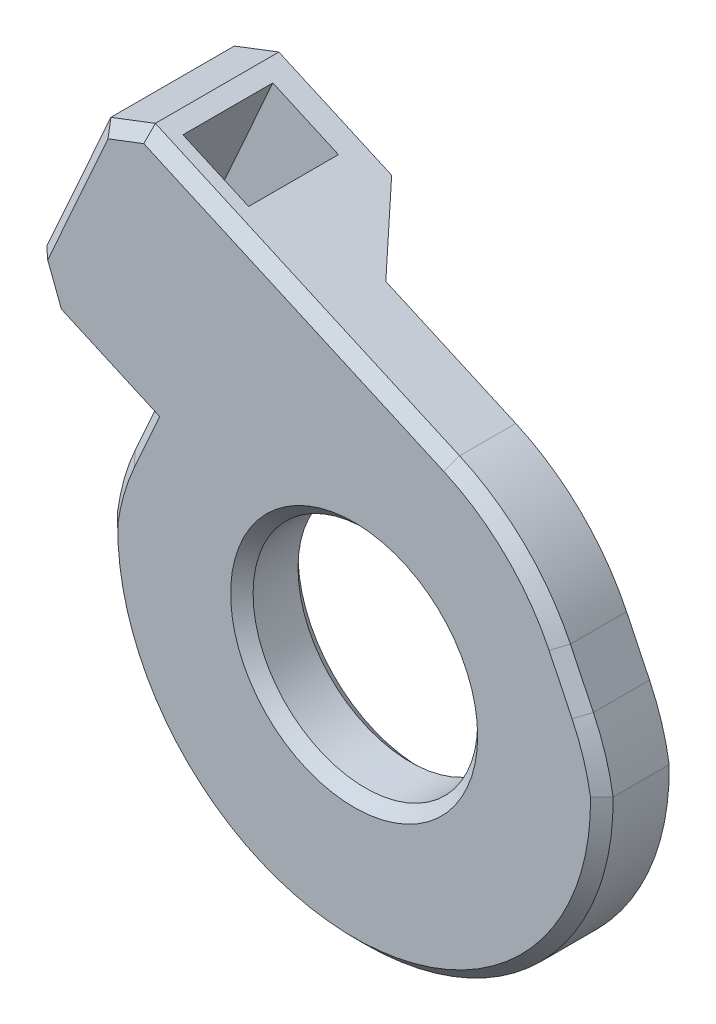
ISO-10303-21;
HEADER;
FILE_DESCRIPTION(('STEP AP214'),'2;1');
FILE_NAME('part.step','',(''),(''),'','','');
FILE_SCHEMA(('AUTOMOTIVE_DESIGN { 1 0 10303 214 1 1 1 1 }'));
ENDSEC;
DATA;
#1=APPLICATION_CONTEXT('core data for automotive mechanical design processes');
#2=APPLICATION_PROTOCOL_DEFINITION('international standard','automotive_design',2000,#1);
#3=PRODUCT_CONTEXT('',#1,'mechanical');
#4=PRODUCT('Part','Part','',(#3));
#5=PRODUCT_RELATED_PRODUCT_CATEGORY('part','',(#4));
#6=PRODUCT_DEFINITION_FORMATION('','',#4);
#7=PRODUCT_DEFINITION_CONTEXT('part definition',#1,'design');
#8=PRODUCT_DEFINITION('design','',#6,#7);
#9=PRODUCT_DEFINITION_SHAPE('','',#8);
#10=(LENGTH_UNIT() NAMED_UNIT(*) SI_UNIT(.MILLI.,.METRE.));
#11=(NAMED_UNIT(*) PLANE_ANGLE_UNIT() SI_UNIT($,.RADIAN.));
#12=(NAMED_UNIT(*) SI_UNIT($,.STERADIAN.) SOLID_ANGLE_UNIT());
#13=UNCERTAINTY_MEASURE_WITH_UNIT(LENGTH_MEASURE(1.E-05),#10,'distance_accuracy_value','');
#14=(GEOMETRIC_REPRESENTATION_CONTEXT(3) GLOBAL_UNCERTAINTY_ASSIGNED_CONTEXT((#13)) GLOBAL_UNIT_ASSIGNED_CONTEXT((#10,
#11,#12)) REPRESENTATION_CONTEXT('',''));
#15=CARTESIAN_POINT('',(0.,0.,0.));
#16=DIRECTION('',(0.,0.,1.));
#17=DIRECTION('',(1.,0.,0.));
#18=AXIS2_PLACEMENT_3D('',#15,#16,#17);
#19=CARTESIAN_POINT('',(-15.9993335903611,0.238477868257378,-6.));
#20=DIRECTION('',(-0.0149038320618569,-0.999888931726855,0.));
#21=DIRECTION('',(0.999888931726855,-0.0149038320618569,0.));
#22=AXIS2_PLACEMENT_3D('',#19,#20,#21);
#23=PLANE('',#22);
#24=DIRECTION('',(-0.999888931726855,0.0149038320618569,0.));
#25=VECTOR('',#24,1.);
#26=CARTESIAN_POINT('',(-15.9993335903611,0.238477868257378,0.));
#27=LINE('',#26,#25);
#28=CARTESIAN_POINT('',(-10.5248777993057,0.156878435409332,0.));
#29=VERTEX_POINT('',#28);
#30=CARTESIAN_POINT('',(-10.5260992697237,0.156896642021487,0.));
#31=VERTEX_POINT('',#30);
#32=EDGE_CURVE('E227',#29,#31,#27,.T.);
#33=ORIENTED_EDGE('',*,*,#32,.T.);
#34=CARTESIAN_POINT('',(-10.5258977055362,0.156893637608992,0.0001999999999994));
#35=CARTESIAN_POINT('',(-10.6099324570567,0.158146216554795,-0.0831834659332892));
#36=CARTESIAN_POINT('',(-10.6939591198566,0.159398674934272,-0.166575082414103));
#37=CARTESIAN_POINT('',(-10.8619962679745,0.161903350559971,-0.333374616430507));
#38=CARTESIAN_POINT('',(-10.9460067532926,0.163155567806193,-0.41678253396609));
#39=CARTESIAN_POINT('',(-11.03000914989,0.16440766448609,-0.500198602049191));
#40=B_SPLINE_CURVE_WITH_KNOTS('',3,(#34,#35,#36,#37,#38,#39),.UNSPECIFIED.,.F.,.F.,(4,2,4),(0.,
0.355170232019879,0.710340463868253),.UNSPECIFIED.);
#41=CARTESIAN_POINT('',(-11.02980914989,0.164404683388573,-0.5));
#42=VERTEX_POINT('',#41);
#43=EDGE_CURVE('E217',#31,#42,#40,.T.);
#44=ORIENTED_EDGE('',*,*,#43,.T.);
#45=CARTESIAN_POINT('',(961.76732595328,-14.3356109401404,-982.604791657124));
#46=DIRECTION('',(0.0149038320618569,0.999888931726855,0.));
#47=DIRECTION('',(0.999888931726855,-0.0149038320618569,0.));
#48=AXIS2_PLACEMENT_3D('',#45,#46,#47);
#49=CIRCLE('',#48,1382.41612342807);
#50=EDGE_CURVE('E223',#42,#29,#49,.T.);
#51=ORIENTED_EDGE('',*,*,#50,.T.);
#52=EDGE_LOOP('',(#33,#44,#51));
#53=FACE_BOUND('',#52,.T.);
#54=ADVANCED_FACE('F33',(#53),#23,.T.);
#55=CARTESIAN_POINT('',(-4.2451482351309,-11.7156911617328,0.));
#56=DIRECTION('',(0.,0.,-1.));
#57=DIRECTION('',(1.,0.,0.));
#58=AXIS2_PLACEMENT_3D('',#55,#56,#57);
#59=PLANE('',#58);
#60=CARTESIAN_POINT('',(0.,0.,0.));
#61=DIRECTION('',(0.,0.,1.));
#62=DIRECTION('',(1.,0.,0.));
#63=AXIS2_PLACEMENT_3D('',#60,#61,#62);
#64=CIRCLE('',#63,5.49999999999999);
#65=CARTESIAN_POINT('',(5.49999999999999,0.,0.));
#66=VERTEX_POINT('',#65);
#67=EDGE_CURVE('E401',#66,#66,#64,.T.);
#68=ORIENTED_EDGE('',*,*,#67,.F.);
#69=EDGE_LOOP('',(#68));
#70=FACE_BOUND('',#69,.T.);
#71=CARTESIAN_POINT('',(1.14507573860424,-1.34954557596995,0.));
#72=DIRECTION('',(0.,0.,1.));
#73=DIRECTION('',(1.,0.,0.));
#74=AXIS2_PLACEMENT_3D('',#71,#72,#73);
#75=CIRCLE('',#74,9.49999999999999);
#76=CARTESIAN_POINT('',(9.70434222245121,2.77222070300485,0.));
#77=VERTEX_POINT('',#76);
#78=CARTESIAN_POINT('',(10.5248777993057,0.156878435409331,0.));
#79=VERTEX_POINT('',#78);
#80=EDGE_CURVE('E398',#77,#79,#75,.F.);
#81=ORIENTED_EDGE('',*,*,#80,.F.);
#82=DIRECTION('',(0.433870134628927,-0.900975419352313,0.));
#83=VECTOR('',#82,1.);
#84=CARTESIAN_POINT('',(12.7418605985402,-3.53549484194215,0.));
#85=LINE('',#84,#83);
#86=CARTESIAN_POINT('',(8.68008532829212,4.89919421670095,0.));
#87=VERTEX_POINT('',#86);
#88=EDGE_CURVE('E395',#87,#77,#85,.T.);
#89=ORIENTED_EDGE('',*,*,#88,.F.);
#90=CARTESIAN_POINT('',(0.120818844445147,0.777427937726146,0.));
#91=DIRECTION('',(0.,0.,1.));
#92=DIRECTION('',(1.,0.,0.));
#93=AXIS2_PLACEMENT_3D('',#90,#91,#92);
#94=CIRCLE('',#93,9.49999999999999);
#95=CARTESIAN_POINT('',(3.99350182799709,9.45223782088251,0.));
#96=VERTEX_POINT('',#95);
#97=EDGE_CURVE('E392',#96,#87,#94,.F.);
#98=ORIENTED_EDGE('',*,*,#97,.F.);
#99=DIRECTION('',(0.913137882437511,-0.407650840373888,0.));
#100=VECTOR('',#99,1.);
#101=CARTESIAN_POINT('',(5.00352415655121,9.00133499563513,0.));
#102=LINE('',#101,#100);
#103=CARTESIAN_POINT('',(-9.36618042540207,15.4163816840071,0.));
#104=VERTEX_POINT('',#103);
#105=EDGE_CURVE('E389',#104,#96,#102,.T.);
#106=ORIENTED_EDGE('',*,*,#105,.F.);
#107=DIRECTION('',(0.933938662414661,0.357433315245115,0.));
#108=VECTOR('',#107,1.);
#109=CARTESIAN_POINT('',(-9.1727553952037,15.4904085474164,0.));
#110=LINE('',#109,#108);
#111=CARTESIAN_POINT('',(-10.9605134492224,14.8062048477302,0.));
#112=VERTEX_POINT('',#111);
#113=EDGE_CURVE('E386',#112,#104,#110,.T.);
#114=ORIENTED_EDGE('',*,*,#113,.F.);
#115=DIRECTION('',(0.407650840373888,0.913137882437511,0.));
#116=VECTOR('',#115,1.);
#117=CARTESIAN_POINT('',(-19.7171077471328,-4.80856637958912,0.));
#118=LINE('',#117,#116);
#119=CARTESIAN_POINT('',(-13.645214825044,8.79247376588988,0.));
#120=VERTEX_POINT('',#119);
#121=EDGE_CURVE('E383',#120,#112,#118,.T.);
#122=ORIENTED_EDGE('',*,*,#121,.F.);
#123=DIRECTION('',(-0.357433315245115,0.933938662414661,0.));
#124=VECTOR('',#123,1.);
#125=CARTESIAN_POINT('',(-13.7192416884533,8.98589879608826,0.));
#126=LINE('',#125,#124);
#127=CARTESIAN_POINT('',(-13.0350379887671,7.19814074206954,0.));
#128=VERTEX_POINT('',#127);
#129=EDGE_CURVE('E380',#128,#120,#126,.T.);
#130=ORIENTED_EDGE('',*,*,#129,.F.);
#131=DIRECTION('',(-0.913137882437511,0.407650840373888,0.));
#132=VECTOR('',#131,1.);
#133=CARTESIAN_POINT('',(1.33466659318622,0.783094053697537,0.));
#134=LINE('',#133,#132);
#135=CARTESIAN_POINT('',(-8.65846562419064,5.24431379359792,0.));
#136=VERTEX_POINT('',#135);
#137=EDGE_CURVE('E377',#136,#128,#134,.T.);
#138=ORIENTED_EDGE('',*,*,#137,.F.);
#139=DIRECTION('',(0.407650840373889,0.913137882437511,0.));
#140=VECTOR('',#139,1.);
#141=CARTESIAN_POINT('',(-14.2382804525078,-7.25447142183244,0.));
#142=LINE('',#141,#140);
#143=CARTESIAN_POINT('',(-9.79445235154937,2.69970352431435,0.));
#144=VERTEX_POINT('',#143);
#145=EDGE_CURVE('E374',#144,#136,#142,.T.);
#146=ORIENTED_EDGE('',*,*,#145,.F.);
#147=CARTESIAN_POINT('',(-1.11964246839302,-1.17297945923759,0.));
#148=DIRECTION('',(0.,0.,1.));
#149=DIRECTION('',(1.,0.,0.));
#150=AXIS2_PLACEMENT_3D('',#147,#148,#149);
#151=CIRCLE('',#150,9.49999999999999);
#152=EDGE_CURVE('E372',#31,#144,#151,.F.);
#153=ORIENTED_EDGE('',*,*,#152,.F.);
#154=ORIENTED_EDGE('',*,*,#32,.F.);
#155=CARTESIAN_POINT('',(0.,0.,0.));
#156=DIRECTION('',(0.,0.,1.));
#157=DIRECTION('',(1.,0.,0.));
#158=AXIS2_PLACEMENT_3D('',#155,#156,#157);
#159=CIRCLE('',#158,10.526046909159);
#160=EDGE_CURVE('E52',#29,#79,#159,.T.);
#161=ORIENTED_EDGE('',*,*,#160,.T.);
#162=EDGE_LOOP('',(#81,#89,#98,#106,#114,#122,#130,#138,#146,#153,#154,#161));
#163=FACE_BOUND('',#162,.T.);
#164=ADVANCED_FACE('F297',(#70,#163),#59,.F.);
#165=CARTESIAN_POINT('',(0.,0.,-3.));
#166=DIRECTION('',(0.,0.,-1.));
#167=DIRECTION('',(1.,0.,0.));
#168=AXIS2_PLACEMENT_3D('',#165,#166,#167);
#169=PLANE('',#168);
#170=CARTESIAN_POINT('',(0.,0.,-3.));
#171=DIRECTION('',(0.,0.,1.));
#172=DIRECTION('',(1.,0.,0.));
#173=AXIS2_PLACEMENT_3D('',#170,#171,#172);
#174=CIRCLE('',#173,11.0310343478261);
#175=CARTESIAN_POINT('',(-11.02980914989,0.164404683388573,-3.));
#176=VERTEX_POINT('',#175);
#177=CARTESIAN_POINT('',(11.0298091498901,0.164404683388573,-3.));
#178=VERTEX_POINT('',#177);
#179=EDGE_CURVE('E228',#176,#178,#174,.T.);
#180=ORIENTED_EDGE('',*,*,#179,.F.);
#181=CARTESIAN_POINT('',(-1.11964246839302,-1.17297945923759,-3.));
#182=DIRECTION('',(0.,0.,1.));
#183=DIRECTION('',(1.,0.,0.));
#184=AXIS2_PLACEMENT_3D('',#181,#182,#183);
#185=CIRCLE('',#184,10.);
#186=CARTESIAN_POINT('',(-10.2510212927681,2.9035289445013,-3.));
#187=VERTEX_POINT('',#186);
#188=EDGE_CURVE('E208',#187,#176,#185,.T.);
#189=ORIENTED_EDGE('',*,*,#188,.F.);
#190=DIRECTION('',(-0.407650840373889,-0.913137882437511,0.));
#191=VECTOR('',#190,1.);
#192=CARTESIAN_POINT('',(-10.9494633470919,1.33901874281605,-3.));
#193=LINE('',#192,#191);
#194=CARTESIAN_POINT('',(-9.31885998559635,4.9915702725661,-3.));
#195=VERTEX_POINT('',#194);
#196=EDGE_CURVE('E356',#195,#187,#193,.T.);
#197=ORIENTED_EDGE('',*,*,#196,.F.);
#198=DIRECTION('',(-0.913137882437511,0.407650840373888,0.));
#199=VECTOR('',#198,1.);
#200=CARTESIAN_POINT('',(-13.3700468447189,6.80013583467437,-3.));
#201=LINE('',#200,#199);
#202=CARTESIAN_POINT('',(-5.6663084558463,3.36096691107054,-3.));
#203=VERTEX_POINT('',#202);
#204=EDGE_CURVE('E463',#203,#195,#201,.T.);
#205=ORIENTED_EDGE('',*,*,#204,.F.);
#206=DIRECTION('',(-0.407650840373888,-0.913137882437511,0.));
#207=VECTOR('',#206,1.);
#208=CARTESIAN_POINT('',(-5.6663084558463,3.36096691107054,-3.));
#209=LINE('',#208,#207);
#210=CARTESIAN_POINT('',(-1.58980005210742,12.4923457354457,-3.));
#211=VERTEX_POINT('',#210);
#212=EDGE_CURVE('E453',#211,#203,#209,.T.);
#213=ORIENTED_EDGE('',*,*,#212,.F.);
#214=DIRECTION('',(-0.913137882437512,0.407650840373888,0.));
#215=VECTOR('',#214,1.);
#216=CARTESIAN_POINT('',(-10.7211788764825,16.5688541391845,-3.));
#217=LINE('',#216,#215);
#218=CARTESIAN_POINT('',(4.19732724818404,9.90880676210126,-3.));
#219=VERTEX_POINT('',#218);
#220=EDGE_CURVE('E355',#219,#211,#217,.T.);
#221=ORIENTED_EDGE('',*,*,#220,.F.);
#222=CARTESIAN_POINT('',(0.120818844445147,0.777427937726146,-3.));
#223=DIRECTION('',(0.,0.,1.));
#224=DIRECTION('',(1.,0.,0.));
#225=AXIS2_PLACEMENT_3D('',#222,#223,#224);
#226=CIRCLE('',#225,10.);
#227=CARTESIAN_POINT('',(9.13057303796828,5.11612928401542,-3.));
#228=VERTEX_POINT('',#227);
#229=EDGE_CURVE('E342',#228,#219,#226,.T.);
#230=ORIENTED_EDGE('',*,*,#229,.F.);
#231=DIRECTION('',(-0.433870134628927,0.900975419352313,0.));
#232=VECTOR('',#231,1.);
#233=CARTESIAN_POINT('',(10.9494633470919,1.33901874281605,-3.));
#234=LINE('',#233,#232);
#235=CARTESIAN_POINT('',(10.1548299321274,2.98915577031932,-3.));
#236=VERTEX_POINT('',#235);
#237=EDGE_CURVE('E351',#236,#228,#234,.T.);
#238=ORIENTED_EDGE('',*,*,#237,.F.);
#239=CARTESIAN_POINT('',(1.14507573860424,-1.34954557596995,-3.));
#240=DIRECTION('',(0.,0.,1.));
#241=DIRECTION('',(1.,0.,0.));
#242=AXIS2_PLACEMENT_3D('',#239,#240,#241);
#243=CIRCLE('',#242,10.);
#244=EDGE_CURVE('E360',#178,#236,#243,.T.);
#245=ORIENTED_EDGE('',*,*,#244,.F.);
#246=EDGE_LOOP('',(#180,#189,#197,#205,#213,#221,#230,#238,#245));
#247=FACE_BOUND('',#246,.T.);
#248=CARTESIAN_POINT('',(0.,0.,-3.));
#249=DIRECTION('',(0.,0.,1.));
#250=DIRECTION('',(1.,0.,0.));
#251=AXIS2_PLACEMENT_3D('',#248,#249,#250);
#252=CIRCLE('',#251,5.49999999999999);
#253=CARTESIAN_POINT('',(5.49999999999999,0.,-3.));
#254=VERTEX_POINT('',#253);
#255=EDGE_CURVE('E220',#254,#254,#252,.F.);
#256=ORIENTED_EDGE('',*,*,#255,.F.);
#257=EDGE_LOOP('',(#256));
#258=FACE_BOUND('',#257,.T.);
#259=ADVANCED_FACE('F286',(#247,#258),#169,.T.);
#260=CARTESIAN_POINT('',(1.14507573860424,-1.34954557596995,0.));
#261=DIRECTION('',(0.,0.,-1.));
#262=DIRECTION('',(1.,0.,0.));
#263=AXIS2_PLACEMENT_3D('',#260,#261,#262);
#264=CONICAL_SURFACE('',#263,9.49999999999999,0.785398163397454);
#265=CARTESIAN_POINT('',(1.14507573860424,-1.34954557596995,-0.5));
#266=DIRECTION('',(0.,0.,1.));
#267=DIRECTION('',(1.,0.,0.));
#268=AXIS2_PLACEMENT_3D('',#265,#266,#267);
#269=CIRCLE('',#268,10.);
#270=CARTESIAN_POINT('',(11.02980914989,0.164404683388572,-0.499999999999999));
#271=VERTEX_POINT('',#270);
#272=CARTESIAN_POINT('',(10.1548299321274,2.98915577031932,-0.5));
#273=VERTEX_POINT('',#272);
#274=EDGE_CURVE('E410',#271,#273,#269,.T.);
#275=ORIENTED_EDGE('',*,*,#274,.T.);
#276=DIRECTION('',(-0.637085828706418,-0.306792514350437,0.707106781186543));
#277=VECTOR('',#276,1.);
#278=CARTESIAN_POINT('',(10.1548299321274,2.98915577031932,-0.5));
#279=LINE('',#278,#277);
#280=EDGE_CURVE('E447',#273,#77,#279,.T.);
#281=ORIENTED_EDGE('',*,*,#280,.T.);
#282=ORIENTED_EDGE('',*,*,#80,.T.);
#283=CARTESIAN_POINT('',(11.0300091498901,0.164407664486091,-0.500198146029022));
#284=CARTESIAN_POINT('',(10.9458083624873,0.163152610694507,-0.416776787823409));
#285=CARTESIAN_POINT('',(10.8615968496548,0.161897397035162,-0.333366263235881));
#286=CARTESIAN_POINT('',(10.6931523730585,0.159386649979884,-0.166566881226189));
#287=CARTESIAN_POINT('',(10.6089194092948,0.158131116583951,-0.0831780238040435));
#288=CARTESIAN_POINT('',(10.5246757201012,0.156875423320256,0.000199999999998424));
#289=B_SPLINE_CURVE_WITH_KNOTS('',3,(#283,#284,#285,#286,#287,#288),.UNSPECIFIED.,.F.,.F.,(4,2,
4),(0.,0.355604036256066,0.711208072814042),.UNSPECIFIED.);
#290=EDGE_CURVE('E11',#271,#79,#289,.T.);
#291=ORIENTED_EDGE('',*,*,#290,.F.);
#292=EDGE_LOOP('',(#275,#281,#282,#291));
#293=FACE_BOUND('',#292,.T.);
#294=ADVANCED_FACE('F249',(#293),#264,.T.);
#295=CARTESIAN_POINT('',(-1.11964246839302,-1.17297945923759,0.));
#296=DIRECTION('',(0.,0.,-1.));
#297=DIRECTION('',(1.,0.,0.));
#298=AXIS2_PLACEMENT_3D('',#295,#296,#297);
#299=CONICAL_SURFACE('',#298,9.49999999999999,0.785398163397454);
#300=ORIENTED_EDGE('',*,*,#152,.T.);
#301=DIRECTION('',(0.64568598882989,-0.288252673584773,0.707106781186546));
#302=VECTOR('',#301,1.);
#303=CARTESIAN_POINT('',(-10.2510212927681,2.9035289445013,-0.5));
#304=LINE('',#303,#302);
#305=CARTESIAN_POINT('',(-10.2510212927681,2.9035289445013,-0.5));
#306=VERTEX_POINT('',#305);
#307=EDGE_CURVE('E219',#306,#144,#304,.T.);
#308=ORIENTED_EDGE('',*,*,#307,.F.);
#309=CARTESIAN_POINT('',(-1.11964246839302,-1.17297945923759,-0.5));
#310=DIRECTION('',(0.,0.,1.));
#311=DIRECTION('',(1.,0.,0.));
#312=AXIS2_PLACEMENT_3D('',#309,#310,#311);
#313=CIRCLE('',#312,10.);
#314=EDGE_CURVE('E205',#306,#42,#313,.T.);
#315=ORIENTED_EDGE('',*,*,#314,.T.);
#316=ORIENTED_EDGE('',*,*,#43,.F.);
#317=EDGE_LOOP('',(#300,#308,#315,#316));
#318=FACE_BOUND('',#317,.T.);
#319=ADVANCED_FACE('F215',(#318),#299,.T.);
#320=CARTESIAN_POINT('',(10.9494633470919,1.33901874281605,-36.6176859496457));
#321=DIRECTION('',(-0.900975419352313,-0.433870134628927,0.));
#322=DIRECTION('',(0.433870134628927,-0.900975419352313,0.));
#323=AXIS2_PLACEMENT_3D('',#320,#321,#322);
#324=PLANE('',#323);
#325=DIRECTION('',(0.,0.,1.));
#326=VECTOR('',#325,1.);
#327=CARTESIAN_POINT('',(10.1548299321274,2.98915577031932,-36.6176859496457));
#328=LINE('',#327,#326);
#329=EDGE_CURVE('E348',#236,#273,#328,.T.);
#330=ORIENTED_EDGE('',*,*,#329,.F.);
#331=ORIENTED_EDGE('',*,*,#237,.T.);
#332=DIRECTION('',(0.,0.,1.));
#333=VECTOR('',#332,1.);
#334=CARTESIAN_POINT('',(9.13057303796828,5.11612928401542,-36.6176859496457));
#335=LINE('',#334,#333);
#336=CARTESIAN_POINT('',(9.13057303796828,5.11612928401542,-0.5));
#337=VERTEX_POINT('',#336);
#338=EDGE_CURVE('E338',#337,#228,#335,.F.);
#339=ORIENTED_EDGE('',*,*,#338,.F.);
#340=DIRECTION('',(-0.433870134628927,0.900975419352313,0.));
#341=VECTOR('',#340,1.);
#342=CARTESIAN_POINT('',(10.9494633470919,1.33901874281605,-0.5));
#343=LINE('',#342,#341);
#344=EDGE_CURVE('E413',#273,#337,#343,.T.);
#345=ORIENTED_EDGE('',*,*,#344,.F.);
#346=EDGE_LOOP('',(#330,#331,#339,#345));
#347=FACE_BOUND('',#346,.T.);
#348=ADVANCED_FACE('F248',(#347),#324,.F.);
#349=CARTESIAN_POINT('',(-10.9494633470919,1.33901874281605,-36.6176859496457));
#350=DIRECTION('',(0.913137882437511,-0.407650840373889,0.));
#351=DIRECTION('',(0.407650840373889,0.913137882437511,0.));
#352=AXIS2_PLACEMENT_3D('',#349,#350,#351);
#353=PLANE('',#352);
#354=DIRECTION('',(0.,0.,1.));
#355=VECTOR('',#354,1.);
#356=CARTESIAN_POINT('',(-9.31885998559635,4.9915702725661,-36.6176859496457));
#357=LINE('',#356,#355);
#358=CARTESIAN_POINT('',(-9.31885998559635,4.9915702725661,-0.5));
#359=VERTEX_POINT('',#358);
#360=EDGE_CURVE('E459',#195,#359,#357,.T.);
#361=ORIENTED_EDGE('',*,*,#360,.F.);
#362=ORIENTED_EDGE('',*,*,#196,.T.);
#363=DIRECTION('',(0.,0.,1.));
#364=VECTOR('',#363,1.);
#365=CARTESIAN_POINT('',(-10.2510212927681,2.9035289445013,-36.6176859496457));
#366=LINE('',#365,#364);
#367=EDGE_CURVE('E361',#306,#187,#366,.F.);
#368=ORIENTED_EDGE('',*,*,#367,.F.);
#369=DIRECTION('',(-0.407650840373889,-0.913137882437511,0.));
#370=VECTOR('',#369,1.);
#371=CARTESIAN_POINT('',(-10.9494633470919,1.33901874281605,-0.5));
#372=LINE('',#371,#370);
#373=EDGE_CURVE('E221',#359,#306,#372,.T.);
#374=ORIENTED_EDGE('',*,*,#373,.F.);
#375=EDGE_LOOP('',(#361,#362,#368,#374));
#376=FACE_BOUND('',#375,.T.);
#377=ADVANCED_FACE('F525',(#376),#353,.F.);
#378=CARTESIAN_POINT('',(0.,0.,-6.));
#379=DIRECTION('',(0.,0.,1.));
#380=DIRECTION('',(-1.,0.,0.));
#381=AXIS2_PLACEMENT_3D('',#378,#379,#380);
#382=CYLINDRICAL_SURFACE('',#381,5.);
#383=CARTESIAN_POINT('',(0.,0.,-0.499999999999998));
#384=DIRECTION('',(0.,0.,1.));
#385=DIRECTION('',(1.,0.,0.));
#386=AXIS2_PLACEMENT_3D('',#383,#384,#385);
#387=CIRCLE('',#386,5.);
#388=CARTESIAN_POINT('',(5.,0.,-0.499999999999998));
#389=VERTEX_POINT('',#388);
#390=EDGE_CURVE('E407',#389,#389,#387,.F.);
#391=ORIENTED_EDGE('',*,*,#390,.F.);
#392=EDGE_LOOP('',(#391));
#393=FACE_BOUND('',#392,.T.);
#394=CARTESIAN_POINT('',(0.,0.,-2.50000000000001));
#395=DIRECTION('',(0.,0.,1.));
#396=DIRECTION('',(1.,0.,0.));
#397=AXIS2_PLACEMENT_3D('',#394,#395,#396);
#398=CIRCLE('',#397,5.);
#399=CARTESIAN_POINT('',(5.,0.,-2.50000000000001));
#400=VERTEX_POINT('',#399);
#401=EDGE_CURVE('E404',#400,#400,#398,.T.);
#402=ORIENTED_EDGE('',*,*,#401,.F.);
#403=EDGE_LOOP('',(#402));
#404=FACE_BOUND('',#403,.T.);
#405=ADVANCED_FACE('F552',(#393,#404),#382,.F.);
#406=CARTESIAN_POINT('',(-4.2451482351309,-11.7156911617328,-6.));
#407=DIRECTION('',(0.,0.,-1.));
#408=DIRECTION('',(1.,0.,0.));
#409=AXIS2_PLACEMENT_3D('',#406,#407,#408);
#410=PLANE('',#409);
#411=DIRECTION('',(0.913137882437512,-0.407650840373888,0.));
#412=VECTOR('',#411,1.);
#413=CARTESIAN_POINT('',(-9.31885998559635,4.9915702725661,-6.));
#414=LINE('',#413,#412);
#415=CARTESIAN_POINT('',(-13.4279804565652,6.8259990542486,-6.));
#416=VERTEX_POINT('',#415);
#417=CARTESIAN_POINT('',(-8.40572210315885,4.58391943219221,-6.));
#418=VERTEX_POINT('',#417);
#419=EDGE_CURVE('E210',#416,#418,#414,.T.);
#420=ORIENTED_EDGE('',*,*,#419,.F.);
#421=DIRECTION('',(-0.357433315245115,0.933938662414661,0.));
#422=VECTOR('',#421,1.);
#423=CARTESIAN_POINT('',(-6.06519317962719,-12.4122515725894,-6.));
#424=LINE('',#423,#422);
#425=CARTESIAN_POINT('',(-14.1862110196606,8.80718213846571,-6.));
#426=VERTEX_POINT('',#425);
#427=EDGE_CURVE('E496',#426,#416,#424,.F.);
#428=ORIENTED_EDGE('',*,*,#427,.F.);
#429=DIRECTION('',(-0.407650840373888,-0.913137882437512,0.));
#430=VECTOR('',#429,1.);
#431=CARTESIAN_POINT('',(-14.7976872802214,7.43747531480943,-6.));
#432=LINE('',#431,#430);
#433=CARTESIAN_POINT('',(-11.3326551370434,15.1991473155283,-6.));
#434=VERTEX_POINT('',#433);
#435=EDGE_CURVE('E477',#434,#426,#432,.T.);
#436=ORIENTED_EDGE('',*,*,#435,.F.);
#437=DIRECTION('',(0.933938662414661,0.357433315245115,0.));
#438=VECTOR('',#437,1.);
#439=CARTESIAN_POINT('',(-14.1353707223869,14.1265030791622,-6.));
#440=LINE('',#439,#438);
#441=CARTESIAN_POINT('',(-9.35147205282626,15.9573778786237,-6.));
#442=VERTEX_POINT('',#441);
#443=EDGE_CURVE('E493',#442,#434,#440,.F.);
#444=ORIENTED_EDGE('',*,*,#443,.F.);
#445=DIRECTION('',(-0.913137882437512,0.407650840373888,0.));
#446=VECTOR('',#445,1.);
#447=CARTESIAN_POINT('',(-10.7211788764825,16.5688541391845,-6.));
#448=LINE('',#447,#446);
#449=CARTESIAN_POINT('',(-4.32921369941997,13.7152982565673,-6.));
#450=VERTEX_POINT('',#449);
#451=EDGE_CURVE('E480',#450,#442,#448,.T.);
#452=ORIENTED_EDGE('',*,*,#451,.F.);
#453=DIRECTION('',(0.407650840373888,0.913137882437511,0.));
#454=VECTOR('',#453,1.);
#455=CARTESIAN_POINT('',(-4.32921369941997,13.7152982565673,-6.));
#456=LINE('',#455,#454);
#457=EDGE_CURVE('E451',#418,#450,#456,.T.);
#458=ORIENTED_EDGE('',*,*,#457,.F.);
#459=EDGE_LOOP('',(#420,#428,#436,#444,#452,#458));
#460=FACE_BOUND('',#459,.T.);
#461=ADVANCED_FACE('F312',(#460),#410,.T.);
#462=CARTESIAN_POINT('',(-10.7211788764825,16.5688541391845,-36.6176859496457));
#463=DIRECTION('',(-0.407650840373888,-0.913137882437512,0.));
#464=DIRECTION('',(0.913137882437512,-0.407650840373888,0.));
#465=AXIS2_PLACEMENT_3D('',#462,#463,#464);
#466=PLANE('',#465);
#467=DIRECTION('',(0.913137882437512,-0.407650840373888,0.));
#468=VECTOR('',#467,1.);
#469=CARTESIAN_POINT('',(-8.62096174687625,15.6312572063246,-5.));
#470=LINE('',#469,#468);
#471=CARTESIAN_POINT('',(-8.62096174687627,15.6312572063246,-5.));
#472=VERTEX_POINT('',#471);
#473=CARTESIAN_POINT('',(-5.69892052307621,14.3267745171282,-5.));
#474=VERTEX_POINT('',#473);
#475=EDGE_CURVE('E593',#472,#474,#470,.T.);
#476=ORIENTED_EDGE('',*,*,#475,.T.);
#477=DIRECTION('',(0.,0.,1.));
#478=VECTOR('',#477,1.);
#479=CARTESIAN_POINT('',(-5.69892052307621,14.3267745171282,-5.));
#480=LINE('',#479,#478);
#481=CARTESIAN_POINT('',(-5.69892052307621,14.3267745171282,-1.));
#482=VERTEX_POINT('',#481);
#483=EDGE_CURVE('E588',#474,#482,#480,.T.);
#484=ORIENTED_EDGE('',*,*,#483,.T.);
#485=DIRECTION('',(-0.913137882437512,0.407650840373888,0.));
#486=VECTOR('',#485,1.);
#487=CARTESIAN_POINT('',(-8.62096174687625,15.6312572063246,-1.));
#488=LINE('',#487,#486);
#489=CARTESIAN_POINT('',(-8.62096174687625,15.6312572063246,-1.));
#490=VERTEX_POINT('',#489);
#491=EDGE_CURVE('E583',#482,#490,#488,.T.);
#492=ORIENTED_EDGE('',*,*,#491,.T.);
#493=DIRECTION('',(0.,0.,-1.));
#494=VECTOR('',#493,1.);
#495=CARTESIAN_POINT('',(-8.62096174687625,15.6312572063246,-5.));
#496=LINE('',#495,#494);
#497=EDGE_CURVE('E590',#490,#472,#496,.T.);
#498=ORIENTED_EDGE('',*,*,#497,.T.);
#499=EDGE_LOOP('',(#476,#484,#492,#498));
#500=FACE_BOUND('',#499,.T.);
#501=ORIENTED_EDGE('',*,*,#451,.T.);
#502=DIRECTION('',(0.,0.,-1.));
#503=VECTOR('',#502,1.);
#504=CARTESIAN_POINT('',(-9.35147205282626,15.9573778786237,-36.6176859496457));
#505=LINE('',#504,#503);
#506=CARTESIAN_POINT('',(-9.35147205282626,15.9573778786237,-0.5));
#507=VERTEX_POINT('',#506);
#508=EDGE_CURVE('E364',#507,#442,#505,.T.);
#509=ORIENTED_EDGE('',*,*,#508,.F.);
#510=DIRECTION('',(-0.913137882437512,0.407650840373888,0.));
#511=VECTOR('',#510,1.);
#512=CARTESIAN_POINT('',(-10.7211788764825,16.5688541391845,-0.5));
#513=LINE('',#512,#511);
#514=CARTESIAN_POINT('',(4.19732724818403,9.90880676210126,-0.5));
#515=VERTEX_POINT('',#514);
#516=EDGE_CURVE('E416',#515,#507,#513,.T.);
#517=ORIENTED_EDGE('',*,*,#516,.F.);
#518=DIRECTION('',(0.,0.,1.));
#519=VECTOR('',#518,1.);
#520=CARTESIAN_POINT('',(4.19732724818403,9.90880676210126,-36.6176859496457));
#521=LINE('',#520,#519);
#522=EDGE_CURVE('E370',#219,#515,#521,.T.);
#523=ORIENTED_EDGE('',*,*,#522,.F.);
#524=ORIENTED_EDGE('',*,*,#220,.T.);
#525=DIRECTION('',(0.64568598882989,-0.288252673584772,0.707106781186546));
#526=VECTOR('',#525,1.);
#527=CARTESIAN_POINT('',(-1.58980005210742,12.4923457354457,-3.));
#528=LINE('',#527,#526);
#529=EDGE_CURVE('E46',#450,#211,#528,.T.);
#530=ORIENTED_EDGE('',*,*,#529,.F.);
#531=EDGE_LOOP('',(#501,#509,#517,#523,#524,#530));
#532=FACE_BOUND('',#531,.T.);
#533=ADVANCED_FACE('F457',(#500,#532),#466,.F.);
#534=CARTESIAN_POINT('',(-14.7976872802214,7.43747531480943,-36.6176859496457));
#535=DIRECTION('',(0.913137882437512,-0.407650840373888,0.));
#536=DIRECTION('',(0.407650840373888,0.913137882437512,0.));
#537=AXIS2_PLACEMENT_3D('',#534,#535,#536);
#538=PLANE('',#537);
#539=DIRECTION('',(0.,0.,1.));
#540=VECTOR('',#539,1.);
#541=CARTESIAN_POINT('',(-11.3326551370434,15.1991473155283,-36.6176859496457));
#542=LINE('',#541,#540);
#543=CARTESIAN_POINT('',(-11.3326551370434,15.1991473155283,-0.5));
#544=VERTEX_POINT('',#543);
#545=EDGE_CURVE('E488',#434,#544,#542,.T.);
#546=ORIENTED_EDGE('',*,*,#545,.F.);
#547=ORIENTED_EDGE('',*,*,#435,.T.);
#548=DIRECTION('',(0.,0.,-1.));
#549=VECTOR('',#548,1.);
#550=CARTESIAN_POINT('',(-14.1862110196606,8.8071821384657,-36.6176859496457));
#551=LINE('',#550,#549);
#552=CARTESIAN_POINT('',(-14.1862110196606,8.8071821384657,-0.5));
#553=VERTEX_POINT('',#552);
#554=EDGE_CURVE('E491',#553,#426,#551,.T.);
#555=ORIENTED_EDGE('',*,*,#554,.F.);
#556=DIRECTION('',(-0.407650840373888,-0.913137882437512,0.));
#557=VECTOR('',#556,1.);
#558=CARTESIAN_POINT('',(-14.7976872802214,7.43747531480943,-0.5));
#559=LINE('',#558,#557);
#560=EDGE_CURVE('E422',#544,#553,#559,.T.);
#561=ORIENTED_EDGE('',*,*,#560,.F.);
#562=EDGE_LOOP('',(#546,#547,#555,#561));
#563=FACE_BOUND('',#562,.T.);
#564=ADVANCED_FACE('F507',(#563),#538,.F.);
#565=CARTESIAN_POINT('',(-9.31885998559635,4.9915702725661,-36.6176859496457));
#566=DIRECTION('',(0.407650840373888,0.913137882437512,0.));
#567=DIRECTION('',(-0.913137882437512,0.407650840373888,0.));
#568=AXIS2_PLACEMENT_3D('',#565,#566,#567);
#569=PLANE('',#568);
#570=DIRECTION('',(0.913137882437512,-0.407650840373888,0.));
#571=VECTOR('',#570,1.);
#572=CARTESIAN_POINT('',(-12.6974701506151,6.49987838194949,-1.));
#573=LINE('',#572,#571);
#574=CARTESIAN_POINT('',(-12.6974701506151,6.49987838194949,-1.));
#575=VERTEX_POINT('',#574);
#576=CARTESIAN_POINT('',(-9.7754289268151,5.19539569275304,-1.));
#577=VERTEX_POINT('',#576);
#578=EDGE_CURVE('E468',#575,#577,#573,.T.);
#579=ORIENTED_EDGE('',*,*,#578,.T.);
#580=DIRECTION('',(0.,0.,-1.));
#581=VECTOR('',#580,1.);
#582=CARTESIAN_POINT('',(-9.7754289268151,5.19539569275304,-5.));
#583=LINE('',#582,#581);
#584=CARTESIAN_POINT('',(-9.77542892681511,5.19539569275304,-5.));
#585=VERTEX_POINT('',#584);
#586=EDGE_CURVE('E464',#577,#585,#583,.T.);
#587=ORIENTED_EDGE('',*,*,#586,.T.);
#588=DIRECTION('',(-0.913137882437512,0.407650840373888,0.));
#589=VECTOR('',#588,1.);
#590=CARTESIAN_POINT('',(-12.6974701506151,6.49987838194949,-5.));
#591=LINE('',#590,#589);
#592=CARTESIAN_POINT('',(-12.6974701506151,6.49987838194949,-5.));
#593=VERTEX_POINT('',#592);
#594=EDGE_CURVE('E240',#585,#593,#591,.T.);
#595=ORIENTED_EDGE('',*,*,#594,.T.);
#596=DIRECTION('',(0.,0.,1.));
#597=VECTOR('',#596,1.);
#598=CARTESIAN_POINT('',(-12.6974701506151,6.49987838194948,-5.));
#599=LINE('',#598,#597);
#600=EDGE_CURVE('E582',#593,#575,#599,.T.);
#601=ORIENTED_EDGE('',*,*,#600,.T.);
#602=EDGE_LOOP('',(#579,#587,#595,#601));
#603=FACE_BOUND('',#602,.T.);
#604=ORIENTED_EDGE('',*,*,#204,.T.);
#605=ORIENTED_EDGE('',*,*,#360,.T.);
#606=DIRECTION('',(0.913137882437512,-0.407650840373888,0.));
#607=VECTOR('',#606,1.);
#608=CARTESIAN_POINT('',(-9.31885998559635,4.9915702725661,-0.5));
#609=LINE('',#608,#607);
#610=CARTESIAN_POINT('',(-13.4279804565652,6.8259990542486,-0.5));
#611=VERTEX_POINT('',#610);
#612=EDGE_CURVE('E428',#611,#359,#609,.T.);
#613=ORIENTED_EDGE('',*,*,#612,.F.);
#614=DIRECTION('',(0.,0.,1.));
#615=VECTOR('',#614,1.);
#616=CARTESIAN_POINT('',(-13.4279804565652,6.8259990542486,-36.6176859496457));
#617=LINE('',#616,#615);
#618=EDGE_CURVE('E485',#416,#611,#617,.T.);
#619=ORIENTED_EDGE('',*,*,#618,.F.);
#620=ORIENTED_EDGE('',*,*,#419,.T.);
#621=DIRECTION('',(-0.64568598882989,0.288252673584772,-0.707106781186546));
#622=VECTOR('',#621,1.);
#623=CARTESIAN_POINT('',(-5.6663084558463,3.36096691107054,-3.));
#624=LINE('',#623,#622);
#625=EDGE_CURVE('E432',#203,#418,#624,.T.);
#626=ORIENTED_EDGE('',*,*,#625,.F.);
#627=EDGE_LOOP('',(#604,#605,#613,#619,#620,#626));
#628=FACE_BOUND('',#627,.T.);
#629=ADVANCED_FACE('F528',(#603,#628),#569,.F.);
#630=CARTESIAN_POINT('',(-20.40009459145,-10.7540003655206,-5.));
#631=DIRECTION('',(-0.913137882437511,0.407650840373889,0.));
#632=DIRECTION('',(-0.407650840373889,-0.913137882437511,0.));
#633=AXIS2_PLACEMENT_3D('',#630,#631,#632);
#634=PLANE('',#633);
#635=ORIENTED_EDGE('',*,*,#600,.F.);
#636=DIRECTION('',(0.407650840373889,0.913137882437511,0.));
#637=VECTOR('',#636,1.);
#638=CARTESIAN_POINT('',(-20.40009459145,-10.7540003655206,-5.));
#639=LINE('',#638,#637);
#640=EDGE_CURVE('E449',#593,#472,#639,.T.);
#641=ORIENTED_EDGE('',*,*,#640,.T.);
#642=ORIENTED_EDGE('',*,*,#497,.F.);
#643=DIRECTION('',(0.407650840373889,0.913137882437511,0.));
#644=VECTOR('',#643,1.);
#645=CARTESIAN_POINT('',(-20.40009459145,-10.7540003655206,-1.));
#646=LINE('',#645,#644);
#647=EDGE_CURVE('E595',#575,#490,#646,.T.);
#648=ORIENTED_EDGE('',*,*,#647,.F.);
#649=EDGE_LOOP('',(#635,#641,#642,#648));
#650=FACE_BOUND('',#649,.T.);
#651=ADVANCED_FACE('F531',(#650),#634,.F.);
#652=CARTESIAN_POINT('',(-20.40009459145,-10.7540003655206,-1.));
#653=DIRECTION('',(0.,0.,1.));
#654=DIRECTION('',(-1.,0.,0.));
#655=AXIS2_PLACEMENT_3D('',#652,#653,#654);
#656=PLANE('',#655);
#657=ORIENTED_EDGE('',*,*,#578,.F.);
#658=ORIENTED_EDGE('',*,*,#647,.T.);
#659=ORIENTED_EDGE('',*,*,#491,.F.);
#660=DIRECTION('',(0.407650840373889,0.913137882437511,0.));
#661=VECTOR('',#660,1.);
#662=CARTESIAN_POINT('',(-17.4780533676499,-12.058483054717,-1.));
#663=LINE('',#662,#661);
#664=EDGE_CURVE('E471',#577,#482,#663,.T.);
#665=ORIENTED_EDGE('',*,*,#664,.F.);
#666=EDGE_LOOP('',(#657,#658,#659,#665));
#667=FACE_BOUND('',#666,.T.);
#668=ADVANCED_FACE('F538',(#667),#656,.F.);
#669=CARTESIAN_POINT('',(-17.4780533676499,-12.058483054717,-5.));
#670=DIRECTION('',(0.913137882437511,-0.407650840373889,0.));
#671=DIRECTION('',(0.407650840373889,0.913137882437511,0.));
#672=AXIS2_PLACEMENT_3D('',#669,#670,#671);
#673=PLANE('',#672);
#674=ORIENTED_EDGE('',*,*,#586,.F.);
#675=ORIENTED_EDGE('',*,*,#664,.T.);
#676=ORIENTED_EDGE('',*,*,#483,.F.);
#677=DIRECTION('',(0.407650840373889,0.913137882437511,0.));
#678=VECTOR('',#677,1.);
#679=CARTESIAN_POINT('',(-17.4780533676499,-12.058483054717,-5.));
#680=LINE('',#679,#678);
#681=EDGE_CURVE('E578',#585,#474,#680,.T.);
#682=ORIENTED_EDGE('',*,*,#681,.F.);
#683=EDGE_LOOP('',(#674,#675,#676,#682));
#684=FACE_BOUND('',#683,.T.);
#685=ADVANCED_FACE('F565',(#684),#673,.F.);
#686=CARTESIAN_POINT('',(-20.40009459145,-10.7540003655206,-5.));
#687=DIRECTION('',(0.,0.,-1.));
#688=DIRECTION('',(1.,0.,0.));
#689=AXIS2_PLACEMENT_3D('',#686,#687,#688);
#690=PLANE('',#689);
#691=ORIENTED_EDGE('',*,*,#594,.F.);
#692=ORIENTED_EDGE('',*,*,#681,.T.);
#693=ORIENTED_EDGE('',*,*,#475,.F.);
#694=ORIENTED_EDGE('',*,*,#640,.F.);
#695=EDGE_LOOP('',(#691,#692,#693,#694));
#696=FACE_BOUND('',#695,.T.);
#697=ADVANCED_FACE('F318',(#696),#690,.F.);
#698=CARTESIAN_POINT('',(-13.4279804565652,6.8259990542486,-36.6176859496457));
#699=DIRECTION('',(0.933938662414661,0.357433315245115,0.));
#700=DIRECTION('',(0.,0.,1.));
#701=AXIS2_PLACEMENT_3D('',#698,#699,#700);
#702=PLANE('',#701);
#703=ORIENTED_EDGE('',*,*,#554,.T.);
#704=ORIENTED_EDGE('',*,*,#427,.T.);
#705=ORIENTED_EDGE('',*,*,#618,.T.);
#706=DIRECTION('',(-0.357433315245115,0.933938662414661,0.));
#707=VECTOR('',#706,1.);
#708=CARTESIAN_POINT('',(-13.4279804565652,6.8259990542486,-0.5));
#709=LINE('',#708,#707);
#710=EDGE_CURVE('E425',#553,#611,#709,.F.);
#711=ORIENTED_EDGE('',*,*,#710,.F.);
#712=EDGE_LOOP('',(#703,#704,#705,#711));
#713=FACE_BOUND('',#712,.T.);
#714=ADVANCED_FACE('F314',(#713),#702,.F.);
#715=CARTESIAN_POINT('',(-11.3326551370434,15.1991473155283,-36.6176859496457));
#716=DIRECTION('',(0.357433315245115,-0.933938662414661,0.));
#717=DIRECTION('',(0.,0.,1.));
#718=AXIS2_PLACEMENT_3D('',#715,#716,#717);
#719=PLANE('',#718);
#720=ORIENTED_EDGE('',*,*,#508,.T.);
#721=ORIENTED_EDGE('',*,*,#443,.T.);
#722=ORIENTED_EDGE('',*,*,#545,.T.);
#723=DIRECTION('',(0.933938662414661,0.357433315245115,0.));
#724=VECTOR('',#723,1.);
#725=CARTESIAN_POINT('',(-11.3326551370434,15.1991473155283,-0.500000000000001));
#726=LINE('',#725,#724);
#727=EDGE_CURVE('E419',#507,#544,#726,.F.);
#728=ORIENTED_EDGE('',*,*,#727,.F.);
#729=EDGE_LOOP('',(#720,#721,#722,#728));
#730=FACE_BOUND('',#729,.T.);
#731=ADVANCED_FACE('F317',(#730),#719,.F.);
#732=CARTESIAN_POINT('',(-1.11964246839302,-1.17297945923759,-6.));
#733=DIRECTION('',(0.,0.,1.));
#734=DIRECTION('',(-1.,0.,0.));
#735=AXIS2_PLACEMENT_3D('',#732,#733,#734);
#736=CYLINDRICAL_SURFACE('',#735,10.);
#737=ORIENTED_EDGE('',*,*,#367,.T.);
#738=ORIENTED_EDGE('',*,*,#188,.T.);
#739=DIRECTION('',(0.,0.,1.));
#740=VECTOR('',#739,1.);
#741=CARTESIAN_POINT('',(-11.02980914989,0.164404683388573,-6.));
#742=LINE('',#741,#740);
#743=EDGE_CURVE('E196',#176,#42,#742,.T.);
#744=ORIENTED_EDGE('',*,*,#743,.T.);
#745=ORIENTED_EDGE('',*,*,#314,.F.);
#746=EDGE_LOOP('',(#737,#738,#744,#745));
#747=FACE_BOUND('',#746,.T.);
#748=ADVANCED_FACE('F204',(#747),#736,.T.);
#749=CARTESIAN_POINT('',(1.14507573860424,-1.34954557596995,-6.));
#750=DIRECTION('',(0.,0.,1.));
#751=DIRECTION('',(-1.,0.,0.));
#752=AXIS2_PLACEMENT_3D('',#749,#750,#751);
#753=CYLINDRICAL_SURFACE('',#752,10.);
#754=DIRECTION('',(0.,0.,1.));
#755=VECTOR('',#754,1.);
#756=CARTESIAN_POINT('',(11.0298091498901,0.164404683388573,-6.));
#757=LINE('',#756,#755);
#758=EDGE_CURVE('E198',#178,#271,#757,.T.);
#759=ORIENTED_EDGE('',*,*,#758,.F.);
#760=ORIENTED_EDGE('',*,*,#244,.T.);
#761=ORIENTED_EDGE('',*,*,#329,.T.);
#762=ORIENTED_EDGE('',*,*,#274,.F.);
#763=EDGE_LOOP('',(#759,#760,#761,#762));
#764=FACE_BOUND('',#763,.T.);
#765=ADVANCED_FACE('F325',(#764),#753,.T.);
#766=CARTESIAN_POINT('',(0.120818844445147,0.777427937726146,-36.6176859496457));
#767=DIRECTION('',(0.,0.,1.));
#768=DIRECTION('',(-1.,0.,0.));
#769=AXIS2_PLACEMENT_3D('',#766,#767,#768);
#770=CYLINDRICAL_SURFACE('',#769,10.);
#771=ORIENTED_EDGE('',*,*,#338,.T.);
#772=ORIENTED_EDGE('',*,*,#229,.T.);
#773=ORIENTED_EDGE('',*,*,#522,.T.);
#774=CARTESIAN_POINT('',(0.120818844445147,0.777427937726146,-0.5));
#775=DIRECTION('',(0.,0.,1.));
#776=DIRECTION('',(1.,0.,0.));
#777=AXIS2_PLACEMENT_3D('',#774,#775,#776);
#778=CIRCLE('',#777,10.);
#779=EDGE_CURVE('E345',#337,#515,#778,.T.);
#780=ORIENTED_EDGE('',*,*,#779,.F.);
#781=EDGE_LOOP('',(#771,#772,#773,#780));
#782=FACE_BOUND('',#781,.T.);
#783=ADVANCED_FACE('F327',(#782),#770,.T.);
#784=CARTESIAN_POINT('',(0.,0.,0.));
#785=DIRECTION('',(0.,0.,1.));
#786=DIRECTION('',(-1.,0.,0.));
#787=AXIS2_PLACEMENT_3D('',#784,#785,#786);
#788=CONICAL_SURFACE('',#787,5.49999999999999,0.785398163397445);
#789=ORIENTED_EDGE('',*,*,#390,.T.);
#790=EDGE_LOOP('',(#789));
#791=FACE_BOUND('',#790,.T.);
#792=ORIENTED_EDGE('',*,*,#67,.T.);
#793=EDGE_LOOP('',(#792));
#794=FACE_BOUND('',#793,.T.);
#795=ADVANCED_FACE('F250',(#791,#794),#788,.F.);
#796=CARTESIAN_POINT('',(10.9494633470919,1.33901874281605,-0.5));
#797=DIRECTION('',(-0.637085828706412,-0.306792514350434,-0.70710678118655));
#798=DIRECTION('',(-0.433870134628927,0.900975419352313,0.));
#799=AXIS2_PLACEMENT_3D('',#796,#797,#798);
#800=PLANE('',#799);
#801=ORIENTED_EDGE('',*,*,#280,.F.);
#802=ORIENTED_EDGE('',*,*,#344,.T.);
#803=DIRECTION('',(-0.637085828706416,-0.306792514350436,0.707106781186545));
#804=VECTOR('',#803,1.);
#805=CARTESIAN_POINT('',(9.13057303796828,5.11612928401542,-0.5));
#806=LINE('',#805,#804);
#807=EDGE_CURVE('E445',#337,#87,#806,.T.);
#808=ORIENTED_EDGE('',*,*,#807,.T.);
#809=ORIENTED_EDGE('',*,*,#88,.T.);
#810=EDGE_LOOP('',(#801,#802,#808,#809));
#811=FACE_BOUND('',#810,.T.);
#812=ADVANCED_FACE('F280',(#811),#800,.F.);
#813=CARTESIAN_POINT('',(0.120818844445147,0.777427937726146,0.));
#814=DIRECTION('',(0.,0.,-1.));
#815=DIRECTION('',(1.,0.,0.));
#816=AXIS2_PLACEMENT_3D('',#813,#814,#815);
#817=CONICAL_SURFACE('',#816,9.49999999999999,0.785398163397454);
#818=ORIENTED_EDGE('',*,*,#807,.F.);
#819=ORIENTED_EDGE('',*,*,#779,.T.);
#820=DIRECTION('',(-0.288252673584772,-0.645685988829892,0.707106781186544));
#821=VECTOR('',#820,1.);
#822=CARTESIAN_POINT('',(4.19732724818403,9.90880676210126,-0.5));
#823=LINE('',#822,#821);
#824=EDGE_CURVE('E443',#515,#96,#823,.T.);
#825=ORIENTED_EDGE('',*,*,#824,.T.);
#826=ORIENTED_EDGE('',*,*,#97,.T.);
#827=EDGE_LOOP('',(#818,#819,#825,#826));
#828=FACE_BOUND('',#827,.T.);
#829=ADVANCED_FACE('F276',(#828),#817,.T.);
#830=CARTESIAN_POINT('',(-10.7211788764825,16.5688541391845,-0.5));
#831=DIRECTION('',(-0.288252673584771,-0.645685988829887,-0.707106781186549));
#832=DIRECTION('',(-0.913137882437512,0.407650840373888,0.));
#833=AXIS2_PLACEMENT_3D('',#830,#831,#832);
#834=PLANE('',#833);
#835=ORIENTED_EDGE('',*,*,#824,.F.);
#836=ORIENTED_EDGE('',*,*,#516,.T.);
#837=DIRECTION('',(-0.019962154561821,-0.734238244144833,0.678598344545846));
#838=VECTOR('',#837,1.);
#839=CARTESIAN_POINT('',(-9.3937597526375,14.4019723054341,0.937538367799393));
#840=LINE('',#839,#838);
#841=EDGE_CURVE('E441',#507,#104,#840,.T.);
#842=ORIENTED_EDGE('',*,*,#841,.T.);
#843=ORIENTED_EDGE('',*,*,#105,.T.);
#844=EDGE_LOOP('',(#835,#836,#842,#843));
#845=FACE_BOUND('',#844,.T.);
#846=ADVANCED_FACE('F272',(#845),#834,.F.);
#847=CARTESIAN_POINT('',(-13.9566540647644,13.6595337479549,0.));
#848=DIRECTION('',(0.252743521031809,-0.6603943614057,-0.707106781186549));
#849=DIRECTION('',(0.933938662414661,0.357433315245115,0.));
#850=AXIS2_PLACEMENT_3D('',#847,#848,#849);
#851=PLANE('',#850);
#852=ORIENTED_EDGE('',*,*,#841,.F.);
#853=ORIENTED_EDGE('',*,*,#727,.T.);
#854=DIRECTION('',(0.505069466583568,-0.533300216299066,0.678598344545844));
#855=VECTOR('',#854,1.);
#856=CARTESIAN_POINT('',(-10.125933358742,13.9249760817492,1.12132034355959));
#857=LINE('',#856,#855);
#858=EDGE_CURVE('E439',#544,#112,#857,.T.);
#859=ORIENTED_EDGE('',*,*,#858,.T.);
#860=ORIENTED_EDGE('',*,*,#113,.T.);
#861=EDGE_LOOP('',(#852,#853,#859,#860));
#862=FACE_BOUND('',#861,.T.);
#863=ADVANCED_FACE('F268',(#862),#851,.F.);
#864=CARTESIAN_POINT('',(-14.7976872802214,7.43747531480943,-0.5));
#865=DIRECTION('',(0.645685988829884,-0.288252673584769,-0.707106781186552));
#866=DIRECTION('',(-0.407650840373888,-0.913137882437512,0.));
#867=AXIS2_PLACEMENT_3D('',#864,#865,#866);
#868=PLANE('',#867);
#869=ORIENTED_EDGE('',*,*,#858,.F.);
#870=ORIENTED_EDGE('',*,*,#560,.T.);
#871=DIRECTION('',(0.734238244144835,-0.0199621545618252,0.678598344545843));
#872=VECTOR('',#871,1.);
#873=CARTESIAN_POINT('',(-8.9988575914618,8.66615059764597,4.29426055101472));
#874=LINE('',#873,#872);
#875=EDGE_CURVE('E437',#553,#120,#874,.T.);
#876=ORIENTED_EDGE('',*,*,#875,.T.);
#877=ORIENTED_EDGE('',*,*,#121,.T.);
#878=EDGE_LOOP('',(#869,#870,#876,#877));
#879=FACE_BOUND('',#878,.T.);
#880=ADVANCED_FACE('F264',(#879),#868,.F.);
#881=CARTESIAN_POINT('',(-5.59822384841986,-12.2335349149669,0.));
#882=DIRECTION('',(0.660394361405698,0.252743521031809,-0.70710678118655));
#883=DIRECTION('',(-0.357433315245115,0.933938662414661,0.));
#884=AXIS2_PLACEMENT_3D('',#881,#882,#883);
#885=PLANE('',#884);
#886=ORIENTED_EDGE('',*,*,#875,.F.);
#887=ORIENTED_EDGE('',*,*,#710,.T.);
#888=DIRECTION('',(0.533300216299065,0.505069466583571,0.678598344545842));
#889=VECTOR('',#888,1.);
#890=CARTESIAN_POINT('',(-12.7534192151527,7.46485176040815,0.358346064237424));
#891=LINE('',#890,#889);
#892=EDGE_CURVE('E435',#611,#128,#891,.T.);
#893=ORIENTED_EDGE('',*,*,#892,.T.);
#894=ORIENTED_EDGE('',*,*,#129,.T.);
#895=EDGE_LOOP('',(#886,#887,#893,#894));
#896=FACE_BOUND('',#895,.T.);
#897=ADVANCED_FACE('F260',(#896),#885,.F.);
#898=CARTESIAN_POINT('',(-9.31885998559635,4.9915702725661,-0.5));
#899=DIRECTION('',(0.288252673584768,0.645685988829882,-0.707106781186555));
#900=DIRECTION('',(0.913137882437512,-0.407650840373888,0.));
#901=AXIS2_PLACEMENT_3D('',#898,#899,#900);
#902=PLANE('',#901);
#903=ORIENTED_EDGE('',*,*,#892,.F.);
#904=ORIENTED_EDGE('',*,*,#612,.T.);
#905=DIRECTION('',(0.762557724657785,0.291843079807307,0.57735026918962));
#906=VECTOR('',#905,1.);
#907=CARTESIAN_POINT('',(-9.31885998559635,4.9915702725661,-0.5));
#908=LINE('',#907,#906);
#909=EDGE_CURVE('E231',#359,#136,#908,.T.);
#910=ORIENTED_EDGE('',*,*,#909,.T.);
#911=ORIENTED_EDGE('',*,*,#137,.T.);
#912=EDGE_LOOP('',(#903,#904,#910,#911));
#913=FACE_BOUND('',#912,.T.);
#914=ADVANCED_FACE('F256',(#913),#902,.F.);
#915=CARTESIAN_POINT('',(-10.9494633470919,1.33901874281605,-0.5));
#916=DIRECTION('',(0.645685988829887,-0.288252673584771,-0.70710678118655));
#917=DIRECTION('',(-0.407650840373889,-0.913137882437511,0.));
#918=AXIS2_PLACEMENT_3D('',#915,#916,#917);
#919=PLANE('',#918);
#920=ORIENTED_EDGE('',*,*,#909,.F.);
#921=ORIENTED_EDGE('',*,*,#373,.T.);
#922=ORIENTED_EDGE('',*,*,#307,.T.);
#923=ORIENTED_EDGE('',*,*,#145,.T.);
#924=EDGE_LOOP('',(#920,#921,#922,#923));
#925=FACE_BOUND('',#924,.T.);
#926=ADVANCED_FACE('F252',(#925),#919,.F.);
#927=CARTESIAN_POINT('',(0.,0.,-2.50000000000001));
#928=DIRECTION('',(0.,0.,-1.));
#929=DIRECTION('',(1.,0.,0.));
#930=AXIS2_PLACEMENT_3D('',#927,#928,#929);
#931=CONICAL_SURFACE('',#930,5.,0.785398163397448);
#932=ORIENTED_EDGE('',*,*,#255,.T.);
#933=EDGE_LOOP('',(#932));
#934=FACE_BOUND('',#933,.T.);
#935=ORIENTED_EDGE('',*,*,#401,.T.);
#936=EDGE_LOOP('',(#935));
#937=FACE_BOUND('',#936,.T.);
#938=ADVANCED_FACE('F255',(#934,#937),#931,.F.);
#939=CARTESIAN_POINT('',(-5.6663084558463,3.36096691107054,-3.));
#940=DIRECTION('',(0.645685988829887,-0.288252673584771,-0.707106781186549));
#941=DIRECTION('',(0.407650840373888,0.913137882437512,0.));
#942=AXIS2_PLACEMENT_3D('',#939,#940,#941);
#943=PLANE('',#942);
#944=ORIENTED_EDGE('',*,*,#529,.T.);
#945=ORIENTED_EDGE('',*,*,#212,.T.);
#946=ORIENTED_EDGE('',*,*,#625,.T.);
#947=ORIENTED_EDGE('',*,*,#457,.T.);
#948=EDGE_LOOP('',(#944,#945,#946,#947));
#949=FACE_BOUND('',#948,.T.);
#950=ADVANCED_FACE('F35',(#949),#943,.T.);
#951=CARTESIAN_POINT('',(0.,0.,-982.604791657124));
#952=DIRECTION('',(0.,0.,-1.));
#953=DIRECTION('',(1.,0.,0.));
#954=AXIS2_PLACEMENT_3D('',#951,#952,#953);
#955=DEGENERATE_TOROIDAL_SURFACE('',#954,961.874159655175,1382.41612342807,.F.);
#956=CARTESIAN_POINT('',(0.,0.,-0.499999999998835));
#957=DIRECTION('',(0.,0.,1.));
#958=DIRECTION('',(1.,0.,0.));
#959=AXIS2_PLACEMENT_3D('',#956,#957,#958);
#960=CIRCLE('',#959,11.0310343478249);
#961=EDGE_CURVE('E192',#42,#271,#960,.T.);
#962=ORIENTED_EDGE('',*,*,#961,.T.);
#963=ORIENTED_EDGE('',*,*,#290,.T.);
#964=ORIENTED_EDGE('',*,*,#160,.F.);
#965=ORIENTED_EDGE('',*,*,#50,.F.);
#966=EDGE_LOOP('',(#962,#963,#964,#965));
#967=FACE_BOUND('',#966,.T.);
#968=ADVANCED_FACE('F224',(#967),#955,.F.);
#969=CARTESIAN_POINT('',(0.,0.,-2.50000000000001));
#970=DIRECTION('',(0.,0.,-1.));
#971=DIRECTION('',(1.,0.,0.));
#972=AXIS2_PLACEMENT_3D('',#969,#970,#971);
#973=CYLINDRICAL_SURFACE('',#972,11.0310343478255);
#974=ORIENTED_EDGE('',*,*,#179,.T.);
#975=ORIENTED_EDGE('',*,*,#758,.T.);
#976=ORIENTED_EDGE('',*,*,#961,.F.);
#977=ORIENTED_EDGE('',*,*,#743,.F.);
#978=EDGE_LOOP('',(#974,#975,#976,#977));
#979=FACE_BOUND('',#978,.T.);
#980=ADVANCED_FACE('F195',(#979),#973,.T.);
#981=CLOSED_SHELL('',(#54,#164,#259,#294,#319,#348,#377,#405,#461,#533,#564,#629,#651,#668,#685,
#697,#714,#731,#748,#765,#783,#795,#812,#829,#846,#863,#880,#897,#914,#926,#938,#950,#968,#980));
#982=MANIFOLD_SOLID_BREP('B2',#981);
#983=ADVANCED_BREP_SHAPE_REPRESENTATION('',(#18,#982),#14);
#984=SHAPE_DEFINITION_REPRESENTATION(#9,#983);
ENDSEC;
END-ISO-10303-21;
